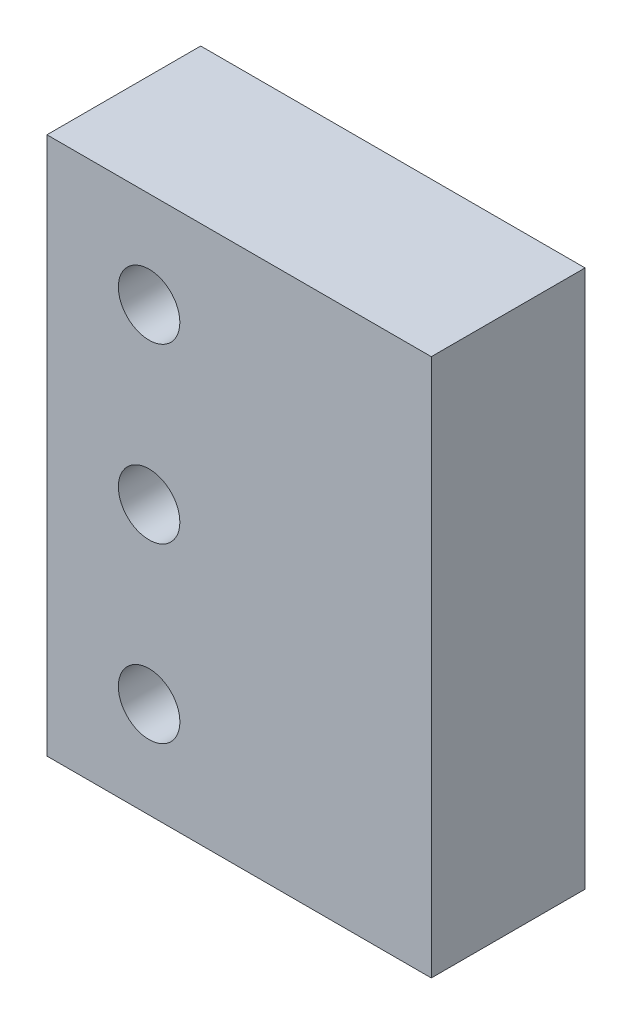
ISO-10303-21;
HEADER;
FILE_DESCRIPTION(('STEP AP214'),'2;1');
FILE_NAME('part.step','',(''),(''),'','','');
FILE_SCHEMA(('AUTOMOTIVE_DESIGN { 1 0 10303 214 1 1 1 1 }'));
ENDSEC;
DATA;
#1=APPLICATION_CONTEXT('core data for automotive mechanical design processes');
#2=APPLICATION_PROTOCOL_DEFINITION('international standard','automotive_design',2000,#1);
#3=PRODUCT_CONTEXT('',#1,'mechanical');
#4=PRODUCT('Part','Part','',(#3));
#5=PRODUCT_RELATED_PRODUCT_CATEGORY('part','',(#4));
#6=PRODUCT_DEFINITION_FORMATION('','',#4);
#7=PRODUCT_DEFINITION_CONTEXT('part definition',#1,'design');
#8=PRODUCT_DEFINITION('design','',#6,#7);
#9=PRODUCT_DEFINITION_SHAPE('','',#8);
#10=(LENGTH_UNIT() NAMED_UNIT(*) SI_UNIT(.MILLI.,.METRE.));
#11=(NAMED_UNIT(*) PLANE_ANGLE_UNIT() SI_UNIT($,.RADIAN.));
#12=(NAMED_UNIT(*) SI_UNIT($,.STERADIAN.) SOLID_ANGLE_UNIT());
#13=UNCERTAINTY_MEASURE_WITH_UNIT(LENGTH_MEASURE(1.E-05),#10,'distance_accuracy_value','');
#14=(GEOMETRIC_REPRESENTATION_CONTEXT(3) GLOBAL_UNCERTAINTY_ASSIGNED_CONTEXT((#13)) GLOBAL_UNIT_ASSIGNED_CONTEXT((#10,
#11,#12)) REPRESENTATION_CONTEXT('',''));
#15=CARTESIAN_POINT('',(0.,0.,0.));
#16=DIRECTION('',(0.,0.,1.));
#17=DIRECTION('',(1.,0.,0.));
#18=AXIS2_PLACEMENT_3D('',#15,#16,#17);
#19=CARTESIAN_POINT('',(0.,0.,10.));
#20=DIRECTION('',(0.,0.,-1.));
#21=DIRECTION('',(-1.,0.,0.));
#22=AXIS2_PLACEMENT_3D('',#19,#20,#21);
#23=PLANE('',#22);
#24=DIRECTION('',(0.,1.,0.));
#25=VECTOR('',#24,1.);
#26=CARTESIAN_POINT('',(25.,-35.,10.));
#27=LINE('',#26,#25);
#28=CARTESIAN_POINT('',(25.,-35.,10.));
#29=VERTEX_POINT('',#28);
#30=CARTESIAN_POINT('',(25.,35.,10.));
#31=VERTEX_POINT('',#30);
#32=EDGE_CURVE('E85',#29,#31,#27,.T.);
#33=ORIENTED_EDGE('',*,*,#32,.T.);
#34=DIRECTION('',(-1.,0.,0.));
#35=VECTOR('',#34,1.);
#36=CARTESIAN_POINT('',(-25.,35.,10.));
#37=LINE('',#36,#35);
#38=CARTESIAN_POINT('',(-25.,35.,10.));
#39=VERTEX_POINT('',#38);
#40=EDGE_CURVE('E80',#31,#39,#37,.T.);
#41=ORIENTED_EDGE('',*,*,#40,.T.);
#42=DIRECTION('',(0.,-1.,0.));
#43=VECTOR('',#42,1.);
#44=CARTESIAN_POINT('',(-25.,-35.,10.));
#45=LINE('',#44,#43);
#46=CARTESIAN_POINT('',(-25.,-35.,10.));
#47=VERTEX_POINT('',#46);
#48=EDGE_CURVE('E83',#39,#47,#45,.T.);
#49=ORIENTED_EDGE('',*,*,#48,.T.);
#50=DIRECTION('',(1.,0.,0.));
#51=VECTOR('',#50,1.);
#52=CARTESIAN_POINT('',(-25.,-35.,10.));
#53=LINE('',#52,#51);
#54=EDGE_CURVE('E50',#47,#29,#53,.T.);
#55=ORIENTED_EDGE('',*,*,#54,.T.);
#56=EDGE_LOOP('',(#33,#41,#49,#55));
#57=FACE_BOUND('',#56,.T.);
#58=CARTESIAN_POINT('',(-11.7121497847795,0.,10.));
#59=DIRECTION('',(0.,0.,1.));
#60=DIRECTION('',(1.,0.,0.));
#61=AXIS2_PLACEMENT_3D('',#58,#59,#60);
#62=CIRCLE('',#61,4.);
#63=CARTESIAN_POINT('',(-7.7121497847795,0.,10.));
#64=VERTEX_POINT('',#63);
#65=EDGE_CURVE('E100',#64,#64,#62,.T.);
#66=ORIENTED_EDGE('',*,*,#65,.F.);
#67=EDGE_LOOP('',(#66));
#68=FACE_BOUND('',#67,.T.);
#69=CARTESIAN_POINT('',(-11.7121497847795,22.5,10.));
#70=DIRECTION('',(0.,0.,1.));
#71=DIRECTION('',(1.,0.,0.));
#72=AXIS2_PLACEMENT_3D('',#69,#70,#71);
#73=CIRCLE('',#72,4.);
#74=CARTESIAN_POINT('',(-7.7121497847795,22.5,10.));
#75=VERTEX_POINT('',#74);
#76=EDGE_CURVE('E115',#75,#75,#73,.T.);
#77=ORIENTED_EDGE('',*,*,#76,.F.);
#78=EDGE_LOOP('',(#77));
#79=FACE_BOUND('',#78,.T.);
#80=CARTESIAN_POINT('',(-11.7121497847795,-22.5,10.));
#81=DIRECTION('',(0.,0.,1.));
#82=DIRECTION('',(-1.,0.,0.));
#83=AXIS2_PLACEMENT_3D('',#80,#81,#82);
#84=CIRCLE('',#83,4.);
#85=CARTESIAN_POINT('',(-15.7121497847795,-22.5,10.));
#86=VERTEX_POINT('',#85);
#87=EDGE_CURVE('E121',#86,#86,#84,.T.);
#88=ORIENTED_EDGE('',*,*,#87,.F.);
#89=EDGE_LOOP('',(#88));
#90=FACE_BOUND('',#89,.T.);
#91=ADVANCED_FACE('F33',(#57,#68,#79,#90),#23,.F.);
#92=CARTESIAN_POINT('',(0.,0.,-10.));
#93=DIRECTION('',(0.,0.,-1.));
#94=DIRECTION('',(-1.,0.,0.));
#95=AXIS2_PLACEMENT_3D('',#92,#93,#94);
#96=PLANE('',#95);
#97=CARTESIAN_POINT('',(-11.7121497847795,22.5,-10.));
#98=DIRECTION('',(0.,0.,1.));
#99=DIRECTION('',(1.,0.,0.));
#100=AXIS2_PLACEMENT_3D('',#97,#98,#99);
#101=CIRCLE('',#100,4.);
#102=CARTESIAN_POINT('',(-7.7121497847795,22.5,-10.));
#103=VERTEX_POINT('',#102);
#104=EDGE_CURVE('E118',#103,#103,#101,.T.);
#105=ORIENTED_EDGE('',*,*,#104,.T.);
#106=EDGE_LOOP('',(#105));
#107=FACE_BOUND('',#106,.T.);
#108=DIRECTION('',(0.,1.,0.));
#109=VECTOR('',#108,1.);
#110=CARTESIAN_POINT('',(25.,-35.,-10.));
#111=LINE('',#110,#109);
#112=CARTESIAN_POINT('',(25.,-35.,-10.));
#113=VERTEX_POINT('',#112);
#114=CARTESIAN_POINT('',(25.,35.,-10.));
#115=VERTEX_POINT('',#114);
#116=EDGE_CURVE('E97',#113,#115,#111,.T.);
#117=ORIENTED_EDGE('',*,*,#116,.F.);
#118=DIRECTION('',(1.,0.,0.));
#119=VECTOR('',#118,1.);
#120=CARTESIAN_POINT('',(-25.,-35.,-10.));
#121=LINE('',#120,#119);
#122=CARTESIAN_POINT('',(-25.,-35.,-10.));
#123=VERTEX_POINT('',#122);
#124=EDGE_CURVE('E73',#123,#113,#121,.T.);
#125=ORIENTED_EDGE('',*,*,#124,.F.);
#126=DIRECTION('',(0.,-1.,0.));
#127=VECTOR('',#126,1.);
#128=CARTESIAN_POINT('',(-25.,-35.,-10.));
#129=LINE('',#128,#127);
#130=CARTESIAN_POINT('',(-25.,35.,-10.));
#131=VERTEX_POINT('',#130);
#132=EDGE_CURVE('E67',#131,#123,#129,.T.);
#133=ORIENTED_EDGE('',*,*,#132,.F.);
#134=DIRECTION('',(-1.,0.,0.));
#135=VECTOR('',#134,1.);
#136=CARTESIAN_POINT('',(-25.,35.,-10.));
#137=LINE('',#136,#135);
#138=EDGE_CURVE('E89',#115,#131,#137,.T.);
#139=ORIENTED_EDGE('',*,*,#138,.F.);
#140=EDGE_LOOP('',(#117,#125,#133,#139));
#141=FACE_BOUND('',#140,.T.);
#142=CARTESIAN_POINT('',(-11.7121497847795,0.,-10.));
#143=DIRECTION('',(0.,0.,1.));
#144=DIRECTION('',(1.,0.,0.));
#145=AXIS2_PLACEMENT_3D('',#142,#143,#144);
#146=CIRCLE('',#145,4.);
#147=CARTESIAN_POINT('',(-7.7121497847795,0.,-10.));
#148=VERTEX_POINT('',#147);
#149=EDGE_CURVE('E112',#148,#148,#146,.T.);
#150=ORIENTED_EDGE('',*,*,#149,.T.);
#151=EDGE_LOOP('',(#150));
#152=FACE_BOUND('',#151,.T.);
#153=CARTESIAN_POINT('',(-11.7121497847795,-22.5,-10.));
#154=DIRECTION('',(0.,0.,1.));
#155=DIRECTION('',(-1.,0.,0.));
#156=AXIS2_PLACEMENT_3D('',#153,#154,#155);
#157=CIRCLE('',#156,4.);
#158=CARTESIAN_POINT('',(-15.7121497847795,-22.5,-10.));
#159=VERTEX_POINT('',#158);
#160=EDGE_CURVE('E124',#159,#159,#157,.T.);
#161=ORIENTED_EDGE('',*,*,#160,.T.);
#162=EDGE_LOOP('',(#161));
#163=FACE_BOUND('',#162,.T.);
#164=ADVANCED_FACE('F108',(#107,#141,#152,#163),#96,.T.);
#165=CARTESIAN_POINT('',(25.,-35.,10.));
#166=DIRECTION('',(-1.,0.,0.));
#167=DIRECTION('',(0.,0.,1.));
#168=AXIS2_PLACEMENT_3D('',#165,#166,#167);
#169=PLANE('',#168);
#170=ORIENTED_EDGE('',*,*,#116,.T.);
#171=DIRECTION('',(0.,0.,-1.));
#172=VECTOR('',#171,1.);
#173=CARTESIAN_POINT('',(25.,35.,10.));
#174=LINE('',#173,#172);
#175=EDGE_CURVE('E11',#31,#115,#174,.T.);
#176=ORIENTED_EDGE('',*,*,#175,.F.);
#177=ORIENTED_EDGE('',*,*,#32,.F.);
#178=DIRECTION('',(0.,0.,-1.));
#179=VECTOR('',#178,1.);
#180=CARTESIAN_POINT('',(25.,-35.,10.));
#181=LINE('',#180,#179);
#182=EDGE_CURVE('E93',#29,#113,#181,.T.);
#183=ORIENTED_EDGE('',*,*,#182,.T.);
#184=EDGE_LOOP('',(#170,#176,#177,#183));
#185=FACE_BOUND('',#184,.T.);
#186=ADVANCED_FACE('F35',(#185),#169,.F.);
#187=CARTESIAN_POINT('',(-25.,35.,10.));
#188=DIRECTION('',(0.,-1.,0.));
#189=DIRECTION('',(0.,0.,-1.));
#190=AXIS2_PLACEMENT_3D('',#187,#188,#189);
#191=PLANE('',#190);
#192=ORIENTED_EDGE('',*,*,#138,.T.);
#193=DIRECTION('',(0.,0.,-1.));
#194=VECTOR('',#193,1.);
#195=CARTESIAN_POINT('',(-25.,35.,10.));
#196=LINE('',#195,#194);
#197=EDGE_CURVE('E42',#39,#131,#196,.T.);
#198=ORIENTED_EDGE('',*,*,#197,.F.);
#199=ORIENTED_EDGE('',*,*,#40,.F.);
#200=ORIENTED_EDGE('',*,*,#175,.T.);
#201=EDGE_LOOP('',(#192,#198,#199,#200));
#202=FACE_BOUND('',#201,.T.);
#203=ADVANCED_FACE('F88',(#202),#191,.F.);
#204=CARTESIAN_POINT('',(-25.,-35.,10.));
#205=DIRECTION('',(1.,0.,0.));
#206=DIRECTION('',(0.,0.,-1.));
#207=AXIS2_PLACEMENT_3D('',#204,#205,#206);
#208=PLANE('',#207);
#209=ORIENTED_EDGE('',*,*,#132,.T.);
#210=DIRECTION('',(0.,0.,-1.));
#211=VECTOR('',#210,1.);
#212=CARTESIAN_POINT('',(-25.,-35.,10.));
#213=LINE('',#212,#211);
#214=EDGE_CURVE('E90',#47,#123,#213,.T.);
#215=ORIENTED_EDGE('',*,*,#214,.F.);
#216=ORIENTED_EDGE('',*,*,#48,.F.);
#217=ORIENTED_EDGE('',*,*,#197,.T.);
#218=EDGE_LOOP('',(#209,#215,#216,#217));
#219=FACE_BOUND('',#218,.T.);
#220=ADVANCED_FACE('F91',(#219),#208,.F.);
#221=CARTESIAN_POINT('',(-25.,-35.,10.));
#222=DIRECTION('',(0.,1.,0.));
#223=DIRECTION('',(0.,0.,1.));
#224=AXIS2_PLACEMENT_3D('',#221,#222,#223);
#225=PLANE('',#224);
#226=ORIENTED_EDGE('',*,*,#124,.T.);
#227=ORIENTED_EDGE('',*,*,#182,.F.);
#228=ORIENTED_EDGE('',*,*,#54,.F.);
#229=ORIENTED_EDGE('',*,*,#214,.T.);
#230=EDGE_LOOP('',(#226,#227,#228,#229));
#231=FACE_BOUND('',#230,.T.);
#232=ADVANCED_FACE('F105',(#231),#225,.F.);
#233=CARTESIAN_POINT('',(-11.7121497847795,0.,10.));
#234=DIRECTION('',(0.,0.,-1.));
#235=DIRECTION('',(-1.,0.,0.));
#236=AXIS2_PLACEMENT_3D('',#233,#234,#235);
#237=CYLINDRICAL_SURFACE('',#236,4.);
#238=ORIENTED_EDGE('',*,*,#65,.T.);
#239=EDGE_LOOP('',(#238));
#240=FACE_BOUND('',#239,.T.);
#241=ORIENTED_EDGE('',*,*,#149,.F.);
#242=EDGE_LOOP('',(#241));
#243=FACE_BOUND('',#242,.T.);
#244=ADVANCED_FACE('F141',(#240,#243),#237,.F.);
#245=CARTESIAN_POINT('',(-11.7121497847795,22.5,10.));
#246=DIRECTION('',(0.,0.,-1.));
#247=DIRECTION('',(-1.,0.,0.));
#248=AXIS2_PLACEMENT_3D('',#245,#246,#247);
#249=CYLINDRICAL_SURFACE('',#248,4.);
#250=ORIENTED_EDGE('',*,*,#76,.T.);
#251=EDGE_LOOP('',(#250));
#252=FACE_BOUND('',#251,.T.);
#253=ORIENTED_EDGE('',*,*,#104,.F.);
#254=EDGE_LOOP('',(#253));
#255=FACE_BOUND('',#254,.T.);
#256=ADVANCED_FACE('F187',(#252,#255),#249,.F.);
#257=CARTESIAN_POINT('',(-11.7121497847795,-22.5,10.));
#258=DIRECTION('',(0.,0.,-1.));
#259=DIRECTION('',(-1.,0.,0.));
#260=AXIS2_PLACEMENT_3D('',#257,#258,#259);
#261=CYLINDRICAL_SURFACE('',#260,4.);
#262=ORIENTED_EDGE('',*,*,#87,.T.);
#263=EDGE_LOOP('',(#262));
#264=FACE_BOUND('',#263,.T.);
#265=ORIENTED_EDGE('',*,*,#160,.F.);
#266=EDGE_LOOP('',(#265));
#267=FACE_BOUND('',#266,.T.);
#268=ADVANCED_FACE('F130',(#264,#267),#261,.F.);
#269=CLOSED_SHELL('',(#91,#164,#186,#203,#220,#232,#244,#256,#268));
#270=MANIFOLD_SOLID_BREP('B2',#269);
#271=ADVANCED_BREP_SHAPE_REPRESENTATION('',(#18,#270),#14);
#272=SHAPE_DEFINITION_REPRESENTATION(#9,#271);
ENDSEC;
END-ISO-10303-21;
